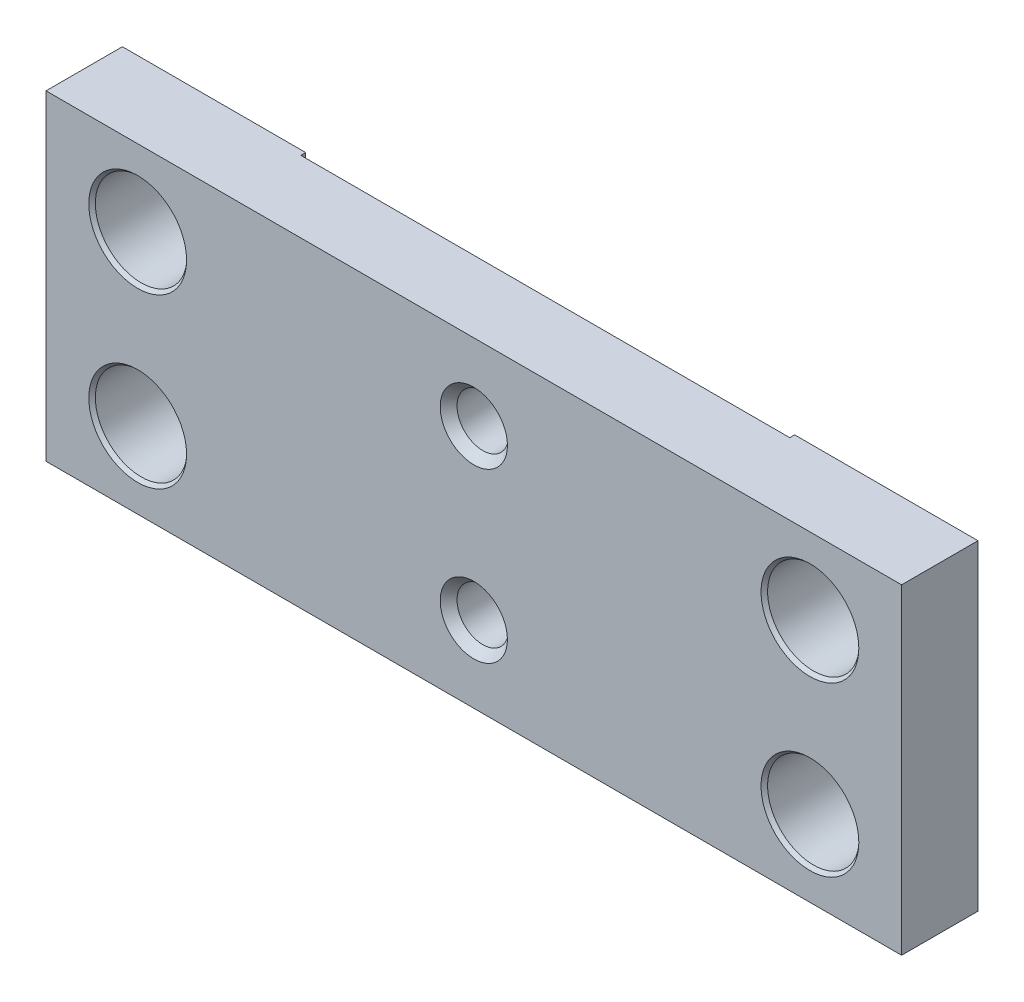
ISO-10303-21;
HEADER;
FILE_DESCRIPTION(('STEP AP214'),'2;1');
FILE_NAME('part.step','',(''),(''),'','','');
FILE_SCHEMA(('AUTOMOTIVE_DESIGN { 1 0 10303 214 1 1 1 1 }'));
ENDSEC;
DATA;
#1=APPLICATION_CONTEXT('core data for automotive mechanical design processes');
#2=APPLICATION_PROTOCOL_DEFINITION('international standard','automotive_design',2000,#1);
#3=PRODUCT_CONTEXT('',#1,'mechanical');
#4=PRODUCT('Part','Part','',(#3));
#5=PRODUCT_RELATED_PRODUCT_CATEGORY('part','',(#4));
#6=PRODUCT_DEFINITION_FORMATION('','',#4);
#7=PRODUCT_DEFINITION_CONTEXT('part definition',#1,'design');
#8=PRODUCT_DEFINITION('design','',#6,#7);
#9=PRODUCT_DEFINITION_SHAPE('','',#8);
#10=(LENGTH_UNIT() NAMED_UNIT(*) SI_UNIT(.MILLI.,.METRE.));
#11=(NAMED_UNIT(*) PLANE_ANGLE_UNIT() SI_UNIT($,.RADIAN.));
#12=(NAMED_UNIT(*) SI_UNIT($,.STERADIAN.) SOLID_ANGLE_UNIT());
#13=UNCERTAINTY_MEASURE_WITH_UNIT(LENGTH_MEASURE(1.E-05),#10,'distance_accuracy_value','');
#14=(GEOMETRIC_REPRESENTATION_CONTEXT(3) GLOBAL_UNCERTAINTY_ASSIGNED_CONTEXT((#13)) GLOBAL_UNIT_ASSIGNED_CONTEXT((#10,
#11,#12)) REPRESENTATION_CONTEXT('',''));
#15=CARTESIAN_POINT('',(0.,0.,0.));
#16=DIRECTION('',(0.,0.,1.));
#17=DIRECTION('',(1.,0.,0.));
#18=AXIS2_PLACEMENT_3D('',#15,#16,#17);
#19=CARTESIAN_POINT('',(-88.9,66.675,15.875));
#20=DIRECTION('',(0.,0.,-1.));
#21=DIRECTION('',(-1.,0.,0.));
#22=AXIS2_PLACEMENT_3D('',#19,#20,#21);
#23=PLANE('',#22);
#24=CARTESIAN_POINT('',(0.,15.875,15.875));
#25=DIRECTION('',(0.,0.,1.));
#26=DIRECTION('',(1.,0.,0.));
#27=AXIS2_PLACEMENT_3D('',#24,#25,#26);
#28=CIRCLE('',#27,6.985);
#29=CARTESIAN_POINT('',(6.985,15.875,15.875));
#30=VERTEX_POINT('',#29);
#31=EDGE_CURVE('E381',#30,#30,#28,.T.);
#32=ORIENTED_EDGE('',*,*,#31,.F.);
#33=EDGE_LOOP('',(#32));
#34=FACE_BOUND('',#33,.T.);
#35=CARTESIAN_POINT('',(-69.85,50.8,15.875));
#36=DIRECTION('',(0.,0.,1.));
#37=DIRECTION('',(1.,0.,0.));
#38=AXIS2_PLACEMENT_3D('',#35,#36,#37);
#39=CIRCLE('',#38,10.16);
#40=CARTESIAN_POINT('',(-59.69,50.8,15.875));
#41=VERTEX_POINT('',#40);
#42=EDGE_CURVE('E176',#41,#41,#39,.T.);
#43=ORIENTED_EDGE('',*,*,#42,.F.);
#44=EDGE_LOOP('',(#43));
#45=FACE_BOUND('',#44,.T.);
#46=CARTESIAN_POINT('',(-69.85,15.875,15.875));
#47=DIRECTION('',(0.,0.,1.));
#48=DIRECTION('',(1.,0.,0.));
#49=AXIS2_PLACEMENT_3D('',#46,#47,#48);
#50=CIRCLE('',#49,10.16);
#51=CARTESIAN_POINT('',(-59.69,15.875,15.875));
#52=VERTEX_POINT('',#51);
#53=EDGE_CURVE('E194',#52,#52,#50,.T.);
#54=ORIENTED_EDGE('',*,*,#53,.F.);
#55=EDGE_LOOP('',(#54));
#56=FACE_BOUND('',#55,.T.);
#57=CARTESIAN_POINT('',(69.85,50.8,15.875));
#58=DIRECTION('',(0.,0.,1.));
#59=DIRECTION('',(1.,0.,0.));
#60=AXIS2_PLACEMENT_3D('',#57,#58,#59);
#61=CIRCLE('',#60,10.16);
#62=CARTESIAN_POINT('',(80.01,50.8,15.875));
#63=VERTEX_POINT('',#62);
#64=EDGE_CURVE('E206',#63,#63,#61,.T.);
#65=ORIENTED_EDGE('',*,*,#64,.F.);
#66=EDGE_LOOP('',(#65));
#67=FACE_BOUND('',#66,.T.);
#68=CARTESIAN_POINT('',(69.85,15.875,15.875));
#69=DIRECTION('',(0.,0.,1.));
#70=DIRECTION('',(1.,0.,0.));
#71=AXIS2_PLACEMENT_3D('',#68,#69,#70);
#72=CIRCLE('',#71,10.16);
#73=CARTESIAN_POINT('',(80.01,15.875,15.875));
#74=VERTEX_POINT('',#73);
#75=EDGE_CURVE('E218',#74,#74,#72,.T.);
#76=ORIENTED_EDGE('',*,*,#75,.F.);
#77=EDGE_LOOP('',(#76));
#78=FACE_BOUND('',#77,.T.);
#79=DIRECTION('',(0.,-1.,0.));
#80=VECTOR('',#79,1.);
#81=CARTESIAN_POINT('',(-88.9,0.,15.875));
#82=LINE('',#81,#80);
#83=CARTESIAN_POINT('',(-88.9,66.675,15.875));
#84=VERTEX_POINT('',#83);
#85=CARTESIAN_POINT('',(-88.9,0.,15.875));
#86=VERTEX_POINT('',#85);
#87=EDGE_CURVE('E231',#84,#86,#82,.T.);
#88=ORIENTED_EDGE('',*,*,#87,.T.);
#89=DIRECTION('',(1.,0.,0.));
#90=VECTOR('',#89,1.);
#91=CARTESIAN_POINT('',(-88.9,0.,15.875));
#92=LINE('',#91,#90);
#93=CARTESIAN_POINT('',(88.9,0.,15.875));
#94=VERTEX_POINT('',#93);
#95=EDGE_CURVE('E234',#86,#94,#92,.T.);
#96=ORIENTED_EDGE('',*,*,#95,.T.);
#97=DIRECTION('',(0.,1.,0.));
#98=VECTOR('',#97,1.);
#99=CARTESIAN_POINT('',(88.9,0.,15.875));
#100=LINE('',#99,#98);
#101=CARTESIAN_POINT('',(88.9,66.675,15.875));
#102=VERTEX_POINT('',#101);
#103=EDGE_CURVE('E237',#94,#102,#100,.T.);
#104=ORIENTED_EDGE('',*,*,#103,.T.);
#105=DIRECTION('',(-1.,0.,0.));
#106=VECTOR('',#105,1.);
#107=CARTESIAN_POINT('',(-88.9,66.675,15.875));
#108=LINE('',#107,#106);
#109=EDGE_CURVE('E239',#102,#84,#108,.T.);
#110=ORIENTED_EDGE('',*,*,#109,.T.);
#111=EDGE_LOOP('',(#88,#96,#104,#110));
#112=FACE_BOUND('',#111,.T.);
#113=CARTESIAN_POINT('',(0.,50.8,15.875));
#114=DIRECTION('',(0.,0.,1.));
#115=DIRECTION('',(1.,0.,0.));
#116=AXIS2_PLACEMENT_3D('',#113,#114,#115);
#117=CIRCLE('',#116,6.985);
#118=CARTESIAN_POINT('',(6.985,50.8,15.875));
#119=VERTEX_POINT('',#118);
#120=EDGE_CURVE('E374',#119,#119,#117,.T.);
#121=ORIENTED_EDGE('',*,*,#120,.F.);
#122=EDGE_LOOP('',(#121));
#123=FACE_BOUND('',#122,.T.);
#124=ADVANCED_FACE('F49',(#34,#45,#56,#67,#78,#112,#123),#23,.F.);
#125=CARTESIAN_POINT('',(-88.9,0.,15.875));
#126=DIRECTION('',(0.,1.,0.));
#127=DIRECTION('',(0.,0.,1.));
#128=AXIS2_PLACEMENT_3D('',#125,#126,#127);
#129=PLANE('',#128);
#130=DIRECTION('',(0.,0.,-1.));
#131=VECTOR('',#130,1.);
#132=CARTESIAN_POINT('',(-19.05,0.,0.));
#133=LINE('',#132,#131);
#134=CARTESIAN_POINT('',(-19.05,0.,6.35));
#135=VERTEX_POINT('',#134);
#136=CARTESIAN_POINT('',(-19.05,0.,1.016));
#137=VERTEX_POINT('',#136);
#138=EDGE_CURVE('E136',#135,#137,#133,.T.);
#139=ORIENTED_EDGE('',*,*,#138,.F.);
#140=DIRECTION('',(1.,0.,0.));
#141=VECTOR('',#140,1.);
#142=CARTESIAN_POINT('',(-19.05,0.,6.35));
#143=LINE('',#142,#141);
#144=CARTESIAN_POINT('',(19.05,0.,6.35));
#145=VERTEX_POINT('',#144);
#146=EDGE_CURVE('E139',#135,#145,#143,.T.);
#147=ORIENTED_EDGE('',*,*,#146,.T.);
#148=DIRECTION('',(0.,0.,-1.));
#149=VECTOR('',#148,1.);
#150=CARTESIAN_POINT('',(19.05,0.,0.));
#151=LINE('',#150,#149);
#152=CARTESIAN_POINT('',(19.05,0.,1.016));
#153=VERTEX_POINT('',#152);
#154=EDGE_CURVE('E151',#145,#153,#151,.T.);
#155=ORIENTED_EDGE('',*,*,#154,.T.);
#156=DIRECTION('',(-1.,0.,0.));
#157=VECTOR('',#156,1.);
#158=CARTESIAN_POINT('',(50.8,0.,1.016));
#159=LINE('',#158,#157);
#160=CARTESIAN_POINT('',(50.8,0.,1.016));
#161=VERTEX_POINT('',#160);
#162=EDGE_CURVE('E162',#161,#153,#159,.T.);
#163=ORIENTED_EDGE('',*,*,#162,.F.);
#164=DIRECTION('',(0.,0.,-1.));
#165=VECTOR('',#164,1.);
#166=CARTESIAN_POINT('',(50.8,0.,1.016));
#167=LINE('',#166,#165);
#168=CARTESIAN_POINT('',(50.8,0.,0.));
#169=VERTEX_POINT('',#168);
#170=EDGE_CURVE('E171',#161,#169,#167,.T.);
#171=ORIENTED_EDGE('',*,*,#170,.T.);
#172=DIRECTION('',(1.,0.,0.));
#173=VECTOR('',#172,1.);
#174=CARTESIAN_POINT('',(-88.9,0.,0.));
#175=LINE('',#174,#173);
#176=CARTESIAN_POINT('',(88.9,0.,0.));
#177=VERTEX_POINT('',#176);
#178=EDGE_CURVE('E244',#169,#177,#175,.T.);
#179=ORIENTED_EDGE('',*,*,#178,.T.);
#180=DIRECTION('',(0.,0.,-1.));
#181=VECTOR('',#180,1.);
#182=CARTESIAN_POINT('',(88.9,0.,15.875));
#183=LINE('',#182,#181);
#184=EDGE_CURVE('E258',#94,#177,#183,.T.);
#185=ORIENTED_EDGE('',*,*,#184,.F.);
#186=ORIENTED_EDGE('',*,*,#95,.F.);
#187=DIRECTION('',(0.,0.,-1.));
#188=VECTOR('',#187,1.);
#189=CARTESIAN_POINT('',(-88.9,0.,15.875));
#190=LINE('',#189,#188);
#191=CARTESIAN_POINT('',(-88.9,0.,0.));
#192=VERTEX_POINT('',#191);
#193=EDGE_CURVE('E261',#86,#192,#190,.T.);
#194=ORIENTED_EDGE('',*,*,#193,.T.);
#195=CARTESIAN_POINT('',(-50.8,0.,0.));
#196=VERTEX_POINT('',#195);
#197=EDGE_CURVE('E245',#192,#196,#175,.T.);
#198=ORIENTED_EDGE('',*,*,#197,.T.);
#199=DIRECTION('',(0.,0.,-1.));
#200=VECTOR('',#199,1.);
#201=CARTESIAN_POINT('',(-50.8,0.,1.016));
#202=LINE('',#201,#200);
#203=CARTESIAN_POINT('',(-50.8,0.,1.016));
#204=VERTEX_POINT('',#203);
#205=EDGE_CURVE('E72',#204,#196,#202,.T.);
#206=ORIENTED_EDGE('',*,*,#205,.F.);
#207=EDGE_CURVE('E149',#137,#204,#159,.T.);
#208=ORIENTED_EDGE('',*,*,#207,.F.);
#209=EDGE_LOOP('',(#139,#147,#155,#163,#171,#179,#185,#186,#194,#198,#206,#208));
#210=FACE_BOUND('',#209,.T.);
#211=ADVANCED_FACE('F148',(#210),#129,.F.);
#212=CARTESIAN_POINT('',(50.8,0.,1.016));
#213=DIRECTION('',(0.,0.,-1.));
#214=DIRECTION('',(-1.,0.,0.));
#215=AXIS2_PLACEMENT_3D('',#212,#213,#214);
#216=PLANE('',#215);
#217=CARTESIAN_POINT('',(0.,50.8,1.016));
#218=DIRECTION('',(0.,0.,-1.));
#219=DIRECTION('',(-1.,0.,0.));
#220=AXIS2_PLACEMENT_3D('',#217,#218,#219);
#221=CIRCLE('',#220,5.35812999999999);
#222=CARTESIAN_POINT('',(-5.35812999999999,50.8,1.016));
#223=VERTEX_POINT('',#222);
#224=EDGE_CURVE('E376',#223,#223,#221,.T.);
#225=ORIENTED_EDGE('',*,*,#224,.F.);
#226=EDGE_LOOP('',(#225));
#227=FACE_BOUND('',#226,.T.);
#228=CARTESIAN_POINT('',(0.,15.875,1.016));
#229=DIRECTION('',(0.,0.,-1.));
#230=DIRECTION('',(-1.,0.,0.));
#231=AXIS2_PLACEMENT_3D('',#228,#229,#230);
#232=CIRCLE('',#231,5.35812999999999);
#233=CARTESIAN_POINT('',(-5.35812999999999,15.875,1.016));
#234=VERTEX_POINT('',#233);
#235=EDGE_CURVE('E154',#234,#234,#232,.T.);
#236=ORIENTED_EDGE('',*,*,#235,.F.);
#237=EDGE_LOOP('',(#236));
#238=FACE_BOUND('',#237,.T.);
#239=DIRECTION('',(1.,0.,0.));
#240=VECTOR('',#239,1.);
#241=CARTESIAN_POINT('',(50.8,9.23875900757253,1.016));
#242=LINE('',#241,#240);
#243=CARTESIAN_POINT('',(-19.05,9.23875900757253,1.016));
#244=VERTEX_POINT('',#243);
#245=CARTESIAN_POINT('',(19.05,9.23875900757253,1.016));
#246=VERTEX_POINT('',#245);
#247=EDGE_CURVE('E57',#244,#246,#242,.T.);
#248=ORIENTED_EDGE('',*,*,#247,.F.);
#249=DIRECTION('',(0.,-1.,0.));
#250=VECTOR('',#249,1.);
#251=CARTESIAN_POINT('',(-19.05,0.,1.016));
#252=LINE('',#251,#250);
#253=EDGE_CURVE('E13',#244,#137,#252,.T.);
#254=ORIENTED_EDGE('',*,*,#253,.T.);
#255=ORIENTED_EDGE('',*,*,#207,.T.);
#256=DIRECTION('',(0.,1.,0.));
#257=VECTOR('',#256,1.);
#258=CARTESIAN_POINT('',(-50.8,66.675,1.016));
#259=LINE('',#258,#257);
#260=CARTESIAN_POINT('',(-50.8,66.675,1.016));
#261=VERTEX_POINT('',#260);
#262=EDGE_CURVE('E165',#204,#261,#259,.T.);
#263=ORIENTED_EDGE('',*,*,#262,.T.);
#264=DIRECTION('',(1.,0.,0.));
#265=VECTOR('',#264,1.);
#266=CARTESIAN_POINT('',(50.8,66.675,1.016));
#267=LINE('',#266,#265);
#268=CARTESIAN_POINT('',(50.8,66.675,1.016));
#269=VERTEX_POINT('',#268);
#270=EDGE_CURVE('E168',#261,#269,#267,.T.);
#271=ORIENTED_EDGE('',*,*,#270,.T.);
#272=DIRECTION('',(0.,-1.,0.));
#273=VECTOR('',#272,1.);
#274=CARTESIAN_POINT('',(50.8,66.675,1.016));
#275=LINE('',#274,#273);
#276=EDGE_CURVE('E158',#269,#161,#275,.T.);
#277=ORIENTED_EDGE('',*,*,#276,.T.);
#278=ORIENTED_EDGE('',*,*,#162,.T.);
#279=DIRECTION('',(0.,-1.,0.));
#280=VECTOR('',#279,1.);
#281=CARTESIAN_POINT('',(19.05,0.,1.016));
#282=LINE('',#281,#280);
#283=EDGE_CURVE('E264',#246,#153,#282,.T.);
#284=ORIENTED_EDGE('',*,*,#283,.F.);
#285=EDGE_LOOP('',(#248,#254,#255,#263,#271,#277,#278,#284));
#286=FACE_BOUND('',#285,.T.);
#287=ADVANCED_FACE('F267',(#227,#238,#286),#216,.T.);
#288=CARTESIAN_POINT('',(-88.9,66.675,0.));
#289=DIRECTION('',(0.,0.,-1.));
#290=DIRECTION('',(-1.,0.,0.));
#291=AXIS2_PLACEMENT_3D('',#288,#289,#290);
#292=PLANE('',#291);
#293=DIRECTION('',(0.,-1.,0.));
#294=VECTOR('',#293,1.);
#295=CARTESIAN_POINT('',(50.8,66.675,0.));
#296=LINE('',#295,#294);
#297=CARTESIAN_POINT('',(50.8,66.675,0.));
#298=VERTEX_POINT('',#297);
#299=EDGE_CURVE('E145',#298,#169,#296,.T.);
#300=ORIENTED_EDGE('',*,*,#299,.F.);
#301=DIRECTION('',(-1.,0.,0.));
#302=VECTOR('',#301,1.);
#303=CARTESIAN_POINT('',(-88.9,66.675,0.));
#304=LINE('',#303,#302);
#305=CARTESIAN_POINT('',(88.9,66.675,0.));
#306=VERTEX_POINT('',#305);
#307=EDGE_CURVE('E235',#306,#298,#304,.T.);
#308=ORIENTED_EDGE('',*,*,#307,.F.);
#309=DIRECTION('',(0.,1.,0.));
#310=VECTOR('',#309,1.);
#311=CARTESIAN_POINT('',(88.9,0.,0.));
#312=LINE('',#311,#310);
#313=EDGE_CURVE('E248',#177,#306,#312,.T.);
#314=ORIENTED_EDGE('',*,*,#313,.F.);
#315=ORIENTED_EDGE('',*,*,#178,.F.);
#316=EDGE_LOOP('',(#300,#308,#314,#315));
#317=FACE_BOUND('',#316,.T.);
#318=CARTESIAN_POINT('',(69.85,15.875,0.));
#319=DIRECTION('',(0.,0.,1.));
#320=DIRECTION('',(1.,0.,0.));
#321=AXIS2_PLACEMENT_3D('',#318,#319,#320);
#322=CIRCLE('',#321,10.16);
#323=CARTESIAN_POINT('',(80.01,15.875,0.));
#324=VERTEX_POINT('',#323);
#325=EDGE_CURVE('E227',#324,#324,#322,.T.);
#326=ORIENTED_EDGE('',*,*,#325,.T.);
#327=EDGE_LOOP('',(#326));
#328=FACE_BOUND('',#327,.T.);
#329=CARTESIAN_POINT('',(69.85,50.8,0.));
#330=DIRECTION('',(0.,0.,1.));
#331=DIRECTION('',(1.,0.,0.));
#332=AXIS2_PLACEMENT_3D('',#329,#330,#331);
#333=CIRCLE('',#332,10.16);
#334=CARTESIAN_POINT('',(80.01,50.8,0.));
#335=VERTEX_POINT('',#334);
#336=EDGE_CURVE('E215',#335,#335,#333,.T.);
#337=ORIENTED_EDGE('',*,*,#336,.T.);
#338=EDGE_LOOP('',(#337));
#339=FACE_BOUND('',#338,.T.);
#340=ADVANCED_FACE('F276',(#317,#328,#339),#292,.T.);
#341=CARTESIAN_POINT('',(-88.9,0.,15.875));
#342=DIRECTION('',(1.,0.,0.));
#343=DIRECTION('',(0.,0.,-1.));
#344=AXIS2_PLACEMENT_3D('',#341,#342,#343);
#345=PLANE('',#344);
#346=DIRECTION('',(0.,-1.,0.));
#347=VECTOR('',#346,1.);
#348=CARTESIAN_POINT('',(-88.9,0.,0.));
#349=LINE('',#348,#347);
#350=CARTESIAN_POINT('',(-88.9,66.675,0.));
#351=VERTEX_POINT('',#350);
#352=EDGE_CURVE('E230',#351,#192,#349,.T.);
#353=ORIENTED_EDGE('',*,*,#352,.T.);
#354=ORIENTED_EDGE('',*,*,#193,.F.);
#355=ORIENTED_EDGE('',*,*,#87,.F.);
#356=DIRECTION('',(0.,0.,-1.));
#357=VECTOR('',#356,1.);
#358=CARTESIAN_POINT('',(-88.9,66.675,15.875));
#359=LINE('',#358,#357);
#360=EDGE_CURVE('E241',#84,#351,#359,.T.);
#361=ORIENTED_EDGE('',*,*,#360,.T.);
#362=EDGE_LOOP('',(#353,#354,#355,#361));
#363=FACE_BOUND('',#362,.T.);
#364=ADVANCED_FACE('F51',(#363),#345,.F.);
#365=CARTESIAN_POINT('',(88.9,0.,15.875));
#366=DIRECTION('',(-1.,0.,0.));
#367=DIRECTION('',(0.,0.,1.));
#368=AXIS2_PLACEMENT_3D('',#365,#366,#367);
#369=PLANE('',#368);
#370=ORIENTED_EDGE('',*,*,#313,.T.);
#371=DIRECTION('',(0.,0.,-1.));
#372=VECTOR('',#371,1.);
#373=CARTESIAN_POINT('',(88.9,66.675,15.875));
#374=LINE('',#373,#372);
#375=EDGE_CURVE('E255',#102,#306,#374,.T.);
#376=ORIENTED_EDGE('',*,*,#375,.F.);
#377=ORIENTED_EDGE('',*,*,#103,.F.);
#378=ORIENTED_EDGE('',*,*,#184,.T.);
#379=EDGE_LOOP('',(#370,#376,#377,#378));
#380=FACE_BOUND('',#379,.T.);
#381=ADVANCED_FACE('F281',(#380),#369,.F.);
#382=CARTESIAN_POINT('',(-88.9,66.675,15.875));
#383=DIRECTION('',(0.,-1.,0.));
#384=DIRECTION('',(0.,0.,-1.));
#385=AXIS2_PLACEMENT_3D('',#382,#383,#384);
#386=PLANE('',#385);
#387=ORIENTED_EDGE('',*,*,#307,.T.);
#388=DIRECTION('',(0.,0.,-1.));
#389=VECTOR('',#388,1.);
#390=CARTESIAN_POINT('',(50.8,66.675,1.016));
#391=LINE('',#390,#389);
#392=EDGE_CURVE('E174',#269,#298,#391,.T.);
#393=ORIENTED_EDGE('',*,*,#392,.F.);
#394=ORIENTED_EDGE('',*,*,#270,.F.);
#395=DIRECTION('',(0.,0.,-1.));
#396=VECTOR('',#395,1.);
#397=CARTESIAN_POINT('',(-50.8,66.675,1.016));
#398=LINE('',#397,#396);
#399=CARTESIAN_POINT('',(-50.8,66.675,0.));
#400=VERTEX_POINT('',#399);
#401=EDGE_CURVE('E177',#261,#400,#398,.T.);
#402=ORIENTED_EDGE('',*,*,#401,.T.);
#403=EDGE_CURVE('E250',#400,#351,#304,.T.);
#404=ORIENTED_EDGE('',*,*,#403,.T.);
#405=ORIENTED_EDGE('',*,*,#360,.F.);
#406=ORIENTED_EDGE('',*,*,#109,.F.);
#407=ORIENTED_EDGE('',*,*,#375,.T.);
#408=EDGE_LOOP('',(#387,#393,#394,#402,#404,#405,#406,#407));
#409=FACE_BOUND('',#408,.T.);
#410=ADVANCED_FACE('F285',(#409),#386,.F.);
#411=DIRECTION('',(0.,1.,0.));
#412=VECTOR('',#411,1.);
#413=CARTESIAN_POINT('',(-50.8,66.675,0.));
#414=LINE('',#413,#412);
#415=EDGE_CURVE('E161',#196,#400,#414,.T.);
#416=ORIENTED_EDGE('',*,*,#415,.F.);
#417=ORIENTED_EDGE('',*,*,#197,.F.);
#418=ORIENTED_EDGE('',*,*,#352,.F.);
#419=ORIENTED_EDGE('',*,*,#403,.F.);
#420=EDGE_LOOP('',(#416,#417,#418,#419));
#421=FACE_BOUND('',#420,.T.);
#422=CARTESIAN_POINT('',(-69.85,50.8,0.));
#423=DIRECTION('',(0.,0.,1.));
#424=DIRECTION('',(1.,0.,0.));
#425=AXIS2_PLACEMENT_3D('',#422,#423,#424);
#426=CIRCLE('',#425,10.16);
#427=CARTESIAN_POINT('',(-59.69,50.8,0.));
#428=VERTEX_POINT('',#427);
#429=EDGE_CURVE('E191',#428,#428,#426,.T.);
#430=ORIENTED_EDGE('',*,*,#429,.T.);
#431=EDGE_LOOP('',(#430));
#432=FACE_BOUND('',#431,.T.);
#433=CARTESIAN_POINT('',(-69.85,15.875,0.));
#434=DIRECTION('',(0.,0.,1.));
#435=DIRECTION('',(1.,0.,0.));
#436=AXIS2_PLACEMENT_3D('',#433,#434,#435);
#437=CIRCLE('',#436,10.16);
#438=CARTESIAN_POINT('',(-59.69,15.875,0.));
#439=VERTEX_POINT('',#438);
#440=EDGE_CURVE('E203',#439,#439,#437,.T.);
#441=ORIENTED_EDGE('',*,*,#440,.T.);
#442=EDGE_LOOP('',(#441));
#443=FACE_BOUND('',#442,.T.);
#444=ADVANCED_FACE('F296',(#421,#432,#443),#292,.T.);
#445=CARTESIAN_POINT('',(69.85,15.875,0.730483938585338));
#446=DIRECTION('',(0.,0.,-1.));
#447=DIRECTION('',(-1.,0.,0.));
#448=AXIS2_PLACEMENT_3D('',#445,#446,#447);
#449=CONICAL_SURFACE('',#448,9.52499999999999,0.715584993317685);
#450=ORIENTED_EDGE('',*,*,#325,.F.);
#451=EDGE_LOOP('',(#450));
#452=FACE_BOUND('',#451,.T.);
#453=CARTESIAN_POINT('',(69.85,15.875,0.730483938585338));
#454=DIRECTION('',(0.,0.,1.));
#455=DIRECTION('',(1.,0.,0.));
#456=AXIS2_PLACEMENT_3D('',#453,#454,#455);
#457=CIRCLE('',#456,9.52499999999999);
#458=CARTESIAN_POINT('',(79.375,15.875,0.730483938585338));
#459=VERTEX_POINT('',#458);
#460=EDGE_CURVE('E224',#459,#459,#457,.T.);
#461=ORIENTED_EDGE('',*,*,#460,.T.);
#462=EDGE_LOOP('',(#461));
#463=FACE_BOUND('',#462,.T.);
#464=ADVANCED_FACE('F322',(#452,#463),#449,.F.);
#465=CARTESIAN_POINT('',(69.85,15.875,15.875));
#466=DIRECTION('',(0.,0.,1.));
#467=DIRECTION('',(1.,0.,0.));
#468=AXIS2_PLACEMENT_3D('',#465,#466,#467);
#469=CYLINDRICAL_SURFACE('',#468,9.52499999999999);
#470=ORIENTED_EDGE('',*,*,#460,.F.);
#471=EDGE_LOOP('',(#470));
#472=FACE_BOUND('',#471,.T.);
#473=CARTESIAN_POINT('',(69.85,15.875,15.1445160614147));
#474=DIRECTION('',(0.,0.,1.));
#475=DIRECTION('',(1.,0.,0.));
#476=AXIS2_PLACEMENT_3D('',#473,#474,#475);
#477=CIRCLE('',#476,9.52499999999999);
#478=CARTESIAN_POINT('',(79.375,15.875,15.1445160614147));
#479=VERTEX_POINT('',#478);
#480=EDGE_CURVE('E221',#479,#479,#477,.T.);
#481=ORIENTED_EDGE('',*,*,#480,.T.);
#482=EDGE_LOOP('',(#481));
#483=FACE_BOUND('',#482,.T.);
#484=ADVANCED_FACE('F565',(#472,#483),#469,.F.);
#485=CARTESIAN_POINT('',(69.85,15.875,15.875));
#486=DIRECTION('',(0.,0.,1.));
#487=DIRECTION('',(1.,0.,0.));
#488=AXIS2_PLACEMENT_3D('',#485,#486,#487);
#489=CONICAL_SURFACE('',#488,10.16,0.715584993317685);
#490=ORIENTED_EDGE('',*,*,#480,.F.);
#491=EDGE_LOOP('',(#490));
#492=FACE_BOUND('',#491,.T.);
#493=ORIENTED_EDGE('',*,*,#75,.T.);
#494=EDGE_LOOP('',(#493));
#495=FACE_BOUND('',#494,.T.);
#496=ADVANCED_FACE('F555',(#492,#495),#489,.F.);
#497=CARTESIAN_POINT('',(69.85,50.8,0.730483938585338));
#498=DIRECTION('',(0.,0.,-1.));
#499=DIRECTION('',(-1.,0.,0.));
#500=AXIS2_PLACEMENT_3D('',#497,#498,#499);
#501=CONICAL_SURFACE('',#500,9.52499999999999,0.715584993317685);
#502=ORIENTED_EDGE('',*,*,#336,.F.);
#503=EDGE_LOOP('',(#502));
#504=FACE_BOUND('',#503,.T.);
#505=CARTESIAN_POINT('',(69.85,50.8,0.730483938585338));
#506=DIRECTION('',(0.,0.,1.));
#507=DIRECTION('',(1.,0.,0.));
#508=AXIS2_PLACEMENT_3D('',#505,#506,#507);
#509=CIRCLE('',#508,9.52499999999999);
#510=CARTESIAN_POINT('',(79.375,50.8,0.730483938585338));
#511=VERTEX_POINT('',#510);
#512=EDGE_CURVE('E212',#511,#511,#509,.T.);
#513=ORIENTED_EDGE('',*,*,#512,.T.);
#514=EDGE_LOOP('',(#513));
#515=FACE_BOUND('',#514,.T.);
#516=ADVANCED_FACE('F545',(#504,#515),#501,.F.);
#517=CARTESIAN_POINT('',(69.85,50.8,15.875));
#518=DIRECTION('',(0.,0.,1.));
#519=DIRECTION('',(1.,0.,0.));
#520=AXIS2_PLACEMENT_3D('',#517,#518,#519);
#521=CYLINDRICAL_SURFACE('',#520,9.52499999999999);
#522=ORIENTED_EDGE('',*,*,#512,.F.);
#523=EDGE_LOOP('',(#522));
#524=FACE_BOUND('',#523,.T.);
#525=CARTESIAN_POINT('',(69.85,50.8,15.1445160614147));
#526=DIRECTION('',(0.,0.,1.));
#527=DIRECTION('',(1.,0.,0.));
#528=AXIS2_PLACEMENT_3D('',#525,#526,#527);
#529=CIRCLE('',#528,9.52499999999999);
#530=CARTESIAN_POINT('',(79.375,50.8,15.1445160614147));
#531=VERTEX_POINT('',#530);
#532=EDGE_CURVE('E209',#531,#531,#529,.T.);
#533=ORIENTED_EDGE('',*,*,#532,.T.);
#534=EDGE_LOOP('',(#533));
#535=FACE_BOUND('',#534,.T.);
#536=ADVANCED_FACE('F535',(#524,#535),#521,.F.);
#537=CARTESIAN_POINT('',(69.85,50.8,15.875));
#538=DIRECTION('',(0.,0.,1.));
#539=DIRECTION('',(1.,0.,0.));
#540=AXIS2_PLACEMENT_3D('',#537,#538,#539);
#541=CONICAL_SURFACE('',#540,10.16,0.715584993317685);
#542=ORIENTED_EDGE('',*,*,#532,.F.);
#543=EDGE_LOOP('',(#542));
#544=FACE_BOUND('',#543,.T.);
#545=ORIENTED_EDGE('',*,*,#64,.T.);
#546=EDGE_LOOP('',(#545));
#547=FACE_BOUND('',#546,.T.);
#548=ADVANCED_FACE('F525',(#544,#547),#541,.F.);
#549=CARTESIAN_POINT('',(-69.85,15.875,0.730483938585338));
#550=DIRECTION('',(0.,0.,-1.));
#551=DIRECTION('',(-1.,0.,0.));
#552=AXIS2_PLACEMENT_3D('',#549,#550,#551);
#553=CONICAL_SURFACE('',#552,9.52499999999999,0.71558499331768);
#554=ORIENTED_EDGE('',*,*,#440,.F.);
#555=EDGE_LOOP('',(#554));
#556=FACE_BOUND('',#555,.T.);
#557=CARTESIAN_POINT('',(-69.85,15.875,0.730483938585338));
#558=DIRECTION('',(0.,0.,1.));
#559=DIRECTION('',(1.,0.,0.));
#560=AXIS2_PLACEMENT_3D('',#557,#558,#559);
#561=CIRCLE('',#560,9.52499999999999);
#562=CARTESIAN_POINT('',(-60.325,15.875,0.730483938585338));
#563=VERTEX_POINT('',#562);
#564=EDGE_CURVE('E200',#563,#563,#561,.T.);
#565=ORIENTED_EDGE('',*,*,#564,.T.);
#566=EDGE_LOOP('',(#565));
#567=FACE_BOUND('',#566,.T.);
#568=ADVANCED_FACE('F515',(#556,#567),#553,.F.);
#569=CARTESIAN_POINT('',(-69.85,15.875,15.875));
#570=DIRECTION('',(0.,0.,1.));
#571=DIRECTION('',(1.,0.,0.));
#572=AXIS2_PLACEMENT_3D('',#569,#570,#571);
#573=CYLINDRICAL_SURFACE('',#572,9.52499999999999);
#574=ORIENTED_EDGE('',*,*,#564,.F.);
#575=EDGE_LOOP('',(#574));
#576=FACE_BOUND('',#575,.T.);
#577=CARTESIAN_POINT('',(-69.85,15.875,15.1445160614147));
#578=DIRECTION('',(0.,0.,1.));
#579=DIRECTION('',(1.,0.,0.));
#580=AXIS2_PLACEMENT_3D('',#577,#578,#579);
#581=CIRCLE('',#580,9.52499999999998);
#582=CARTESIAN_POINT('',(-60.325,15.875,15.1445160614147));
#583=VERTEX_POINT('',#582);
#584=EDGE_CURVE('E197',#583,#583,#581,.T.);
#585=ORIENTED_EDGE('',*,*,#584,.T.);
#586=EDGE_LOOP('',(#585));
#587=FACE_BOUND('',#586,.T.);
#588=ADVANCED_FACE('F505',(#576,#587),#573,.F.);
#589=CARTESIAN_POINT('',(-69.85,15.875,15.875));
#590=DIRECTION('',(0.,0.,1.));
#591=DIRECTION('',(1.,0.,0.));
#592=AXIS2_PLACEMENT_3D('',#589,#590,#591);
#593=CONICAL_SURFACE('',#592,10.16,0.715584993317691);
#594=ORIENTED_EDGE('',*,*,#584,.F.);
#595=EDGE_LOOP('',(#594));
#596=FACE_BOUND('',#595,.T.);
#597=ORIENTED_EDGE('',*,*,#53,.T.);
#598=EDGE_LOOP('',(#597));
#599=FACE_BOUND('',#598,.T.);
#600=ADVANCED_FACE('F495',(#596,#599),#593,.F.);
#601=CARTESIAN_POINT('',(-69.85,50.8,0.730483938585338));
#602=DIRECTION('',(0.,0.,-1.));
#603=DIRECTION('',(-1.,0.,0.));
#604=AXIS2_PLACEMENT_3D('',#601,#602,#603);
#605=CONICAL_SURFACE('',#604,9.52499999999999,0.71558499331768);
#606=ORIENTED_EDGE('',*,*,#429,.F.);
#607=EDGE_LOOP('',(#606));
#608=FACE_BOUND('',#607,.T.);
#609=CARTESIAN_POINT('',(-69.85,50.8,0.730483938585338));
#610=DIRECTION('',(0.,0.,1.));
#611=DIRECTION('',(1.,0.,0.));
#612=AXIS2_PLACEMENT_3D('',#609,#610,#611);
#613=CIRCLE('',#612,9.52499999999999);
#614=CARTESIAN_POINT('',(-60.325,50.8,0.730483938585338));
#615=VERTEX_POINT('',#614);
#616=EDGE_CURVE('E188',#615,#615,#613,.T.);
#617=ORIENTED_EDGE('',*,*,#616,.T.);
#618=EDGE_LOOP('',(#617));
#619=FACE_BOUND('',#618,.T.);
#620=ADVANCED_FACE('F485',(#608,#619),#605,.F.);
#621=CARTESIAN_POINT('',(-69.85,50.8,15.875));
#622=DIRECTION('',(0.,0.,1.));
#623=DIRECTION('',(1.,0.,0.));
#624=AXIS2_PLACEMENT_3D('',#621,#622,#623);
#625=CYLINDRICAL_SURFACE('',#624,9.52499999999999);
#626=ORIENTED_EDGE('',*,*,#616,.F.);
#627=EDGE_LOOP('',(#626));
#628=FACE_BOUND('',#627,.T.);
#629=CARTESIAN_POINT('',(-69.85,50.8,15.1445160614147));
#630=DIRECTION('',(0.,0.,1.));
#631=DIRECTION('',(1.,0.,0.));
#632=AXIS2_PLACEMENT_3D('',#629,#630,#631);
#633=CIRCLE('',#632,9.52499999999998);
#634=CARTESIAN_POINT('',(-60.325,50.8,15.1445160614147));
#635=VERTEX_POINT('',#634);
#636=EDGE_CURVE('E185',#635,#635,#633,.T.);
#637=ORIENTED_EDGE('',*,*,#636,.T.);
#638=EDGE_LOOP('',(#637));
#639=FACE_BOUND('',#638,.T.);
#640=ADVANCED_FACE('F309',(#628,#639),#625,.F.);
#641=CARTESIAN_POINT('',(-69.85,50.8,15.875));
#642=DIRECTION('',(0.,0.,1.));
#643=DIRECTION('',(1.,0.,0.));
#644=AXIS2_PLACEMENT_3D('',#641,#642,#643);
#645=CONICAL_SURFACE('',#644,10.16,0.715584993317691);
#646=ORIENTED_EDGE('',*,*,#636,.F.);
#647=EDGE_LOOP('',(#646));
#648=FACE_BOUND('',#647,.T.);
#649=ORIENTED_EDGE('',*,*,#42,.T.);
#650=EDGE_LOOP('',(#649));
#651=FACE_BOUND('',#650,.T.);
#652=ADVANCED_FACE('F302',(#648,#651),#645,.F.);
#653=CARTESIAN_POINT('',(50.8,66.675,1.016));
#654=DIRECTION('',(1.,0.,0.));
#655=DIRECTION('',(0.,1.,0.));
#656=AXIS2_PLACEMENT_3D('',#653,#654,#655);
#657=PLANE('',#656);
#658=ORIENTED_EDGE('',*,*,#299,.T.);
#659=ORIENTED_EDGE('',*,*,#170,.F.);
#660=ORIENTED_EDGE('',*,*,#276,.F.);
#661=ORIENTED_EDGE('',*,*,#392,.T.);
#662=EDGE_LOOP('',(#658,#659,#660,#661));
#663=FACE_BOUND('',#662,.T.);
#664=ADVANCED_FACE('F300',(#663),#657,.F.);
#665=CARTESIAN_POINT('',(-50.8,66.675,1.016));
#666=DIRECTION('',(-1.,0.,0.));
#667=DIRECTION('',(0.,-1.,0.));
#668=AXIS2_PLACEMENT_3D('',#665,#666,#667);
#669=PLANE('',#668);
#670=ORIENTED_EDGE('',*,*,#415,.T.);
#671=ORIENTED_EDGE('',*,*,#401,.F.);
#672=ORIENTED_EDGE('',*,*,#262,.F.);
#673=ORIENTED_EDGE('',*,*,#205,.T.);
#674=EDGE_LOOP('',(#670,#671,#672,#673));
#675=FACE_BOUND('',#674,.T.);
#676=ADVANCED_FACE('F298',(#675),#669,.F.);
#677=CARTESIAN_POINT('',(-19.05,0.,6.35));
#678=DIRECTION('',(0.,0.499999999999995,0.866025403784442));
#679=DIRECTION('',(0.,-0.866025403784442,0.499999999999995));
#680=AXIS2_PLACEMENT_3D('',#677,#678,#679);
#681=PLANE('',#680);
#682=ORIENTED_EDGE('',*,*,#247,.T.);
#683=DIRECTION('',(0.,-0.866025403784442,0.499999999999995));
#684=VECTOR('',#683,1.);
#685=CARTESIAN_POINT('',(19.05,0.,6.35));
#686=LINE('',#685,#684);
#687=EDGE_CURVE('E64',#246,#145,#686,.T.);
#688=ORIENTED_EDGE('',*,*,#687,.T.);
#689=ORIENTED_EDGE('',*,*,#146,.F.);
#690=DIRECTION('',(0.,-0.866025403784442,0.499999999999995));
#691=VECTOR('',#690,1.);
#692=CARTESIAN_POINT('',(-19.05,0.,6.35));
#693=LINE('',#692,#691);
#694=EDGE_CURVE('E132',#244,#135,#693,.T.);
#695=ORIENTED_EDGE('',*,*,#694,.F.);
#696=EDGE_LOOP('',(#682,#688,#689,#695));
#697=FACE_BOUND('',#696,.T.);
#698=ADVANCED_FACE('F142',(#697),#681,.F.);
#699=CARTESIAN_POINT('',(-19.05,0.,0.));
#700=DIRECTION('',(1.,0.,0.));
#701=DIRECTION('',(0.,0.,-1.));
#702=AXIS2_PLACEMENT_3D('',#699,#700,#701);
#703=PLANE('',#702);
#704=ORIENTED_EDGE('',*,*,#694,.T.);
#705=ORIENTED_EDGE('',*,*,#138,.T.);
#706=ORIENTED_EDGE('',*,*,#253,.F.);
#707=EDGE_LOOP('',(#704,#705,#706));
#708=FACE_BOUND('',#707,.T.);
#709=ADVANCED_FACE('F134',(#708),#703,.T.);
#710=CARTESIAN_POINT('',(19.05,0.,0.));
#711=DIRECTION('',(1.,0.,0.));
#712=DIRECTION('',(0.,0.,-1.));
#713=AXIS2_PLACEMENT_3D('',#710,#711,#712);
#714=PLANE('',#713);
#715=ORIENTED_EDGE('',*,*,#283,.T.);
#716=ORIENTED_EDGE('',*,*,#154,.F.);
#717=ORIENTED_EDGE('',*,*,#687,.F.);
#718=EDGE_LOOP('',(#715,#716,#717));
#719=FACE_BOUND('',#718,.T.);
#720=ADVANCED_FACE('F269',(#719),#714,.F.);
#721=CARTESIAN_POINT('',(0.,15.875,15.875));
#722=DIRECTION('',(0.,0.,1.));
#723=DIRECTION('',(1.,0.,0.));
#724=AXIS2_PLACEMENT_3D('',#721,#722,#723);
#725=CYLINDRICAL_SURFACE('',#724,5.35812999999999);
#726=CARTESIAN_POINT('',(0.,15.875,14.0035001493444));
#727=DIRECTION('',(0.,0.,1.));
#728=DIRECTION('',(1.,0.,0.));
#729=AXIS2_PLACEMENT_3D('',#726,#727,#728);
#730=CIRCLE('',#729,5.35812999999999);
#731=CARTESIAN_POINT('',(5.35812999999999,15.875,14.0035001493444));
#732=VERTEX_POINT('',#731);
#733=EDGE_CURVE('E383',#732,#732,#730,.T.);
#734=ORIENTED_EDGE('',*,*,#733,.T.);
#735=EDGE_LOOP('',(#734));
#736=FACE_BOUND('',#735,.T.);
#737=ORIENTED_EDGE('',*,*,#235,.T.);
#738=EDGE_LOOP('',(#737));
#739=FACE_BOUND('',#738,.T.);
#740=ADVANCED_FACE('F349',(#736,#739),#725,.F.);
#741=CARTESIAN_POINT('',(0.,15.875,15.875));
#742=DIRECTION('',(0.,0.,1.));
#743=DIRECTION('',(1.,0.,0.));
#744=AXIS2_PLACEMENT_3D('',#741,#742,#743);
#745=CONICAL_SURFACE('',#744,6.985,0.715584993317679);
#746=ORIENTED_EDGE('',*,*,#733,.F.);
#747=EDGE_LOOP('',(#746));
#748=FACE_BOUND('',#747,.T.);
#749=ORIENTED_EDGE('',*,*,#31,.T.);
#750=EDGE_LOOP('',(#749));
#751=FACE_BOUND('',#750,.T.);
#752=ADVANCED_FACE('F354',(#748,#751),#745,.F.);
#753=CARTESIAN_POINT('',(0.,50.8,15.875));
#754=DIRECTION('',(0.,0.,1.));
#755=DIRECTION('',(1.,0.,0.));
#756=AXIS2_PLACEMENT_3D('',#753,#754,#755);
#757=CYLINDRICAL_SURFACE('',#756,5.35812999999999);
#758=CARTESIAN_POINT('',(0.,50.8,14.0035001493444));
#759=DIRECTION('',(0.,0.,1.));
#760=DIRECTION('',(1.,0.,0.));
#761=AXIS2_PLACEMENT_3D('',#758,#759,#760);
#762=CIRCLE('',#761,5.35812999999999);
#763=CARTESIAN_POINT('',(5.35812999999999,50.8,14.0035001493444));
#764=VERTEX_POINT('',#763);
#765=EDGE_CURVE('E371',#764,#764,#762,.T.);
#766=ORIENTED_EDGE('',*,*,#765,.T.);
#767=EDGE_LOOP('',(#766));
#768=FACE_BOUND('',#767,.T.);
#769=ORIENTED_EDGE('',*,*,#224,.T.);
#770=EDGE_LOOP('',(#769));
#771=FACE_BOUND('',#770,.T.);
#772=ADVANCED_FACE('F358',(#768,#771),#757,.F.);
#773=CARTESIAN_POINT('',(0.,50.8,15.875));
#774=DIRECTION('',(0.,0.,1.));
#775=DIRECTION('',(1.,0.,0.));
#776=AXIS2_PLACEMENT_3D('',#773,#774,#775);
#777=CONICAL_SURFACE('',#776,6.985,0.715584993317679);
#778=ORIENTED_EDGE('',*,*,#765,.F.);
#779=EDGE_LOOP('',(#778));
#780=FACE_BOUND('',#779,.T.);
#781=ORIENTED_EDGE('',*,*,#120,.T.);
#782=EDGE_LOOP('',(#781));
#783=FACE_BOUND('',#782,.T.);
#784=ADVANCED_FACE('F362',(#780,#783),#777,.F.);
#785=CLOSED_SHELL('',(#124,#211,#287,#340,#364,#381,#410,#444,#464,#484,#496,#516,#536,#548,
#568,#588,#600,#620,#640,#652,#664,#676,#698,#709,#720,#740,#752,#772,#784));
#786=MANIFOLD_SOLID_BREP('B2',#785);
#787=ADVANCED_BREP_SHAPE_REPRESENTATION('',(#18,#786),#14);
#788=SHAPE_DEFINITION_REPRESENTATION(#9,#787);
ENDSEC;
END-ISO-10303-21;
